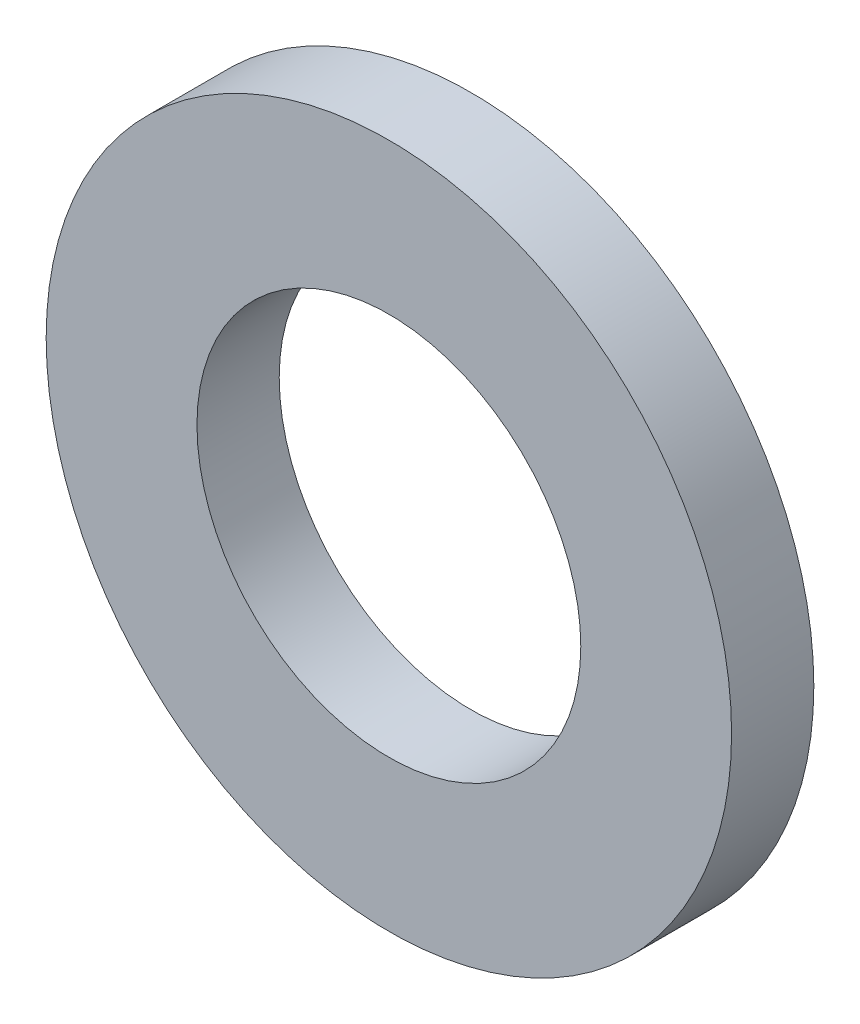
ISO-10303-21;
HEADER;
FILE_DESCRIPTION(('STEP AP214'),'2;1');
FILE_NAME('part.step','',(''),(''),'','','');
FILE_SCHEMA(('AUTOMOTIVE_DESIGN { 1 0 10303 214 1 1 1 1 }'));
ENDSEC;
DATA;
#1=APPLICATION_CONTEXT('core data for automotive mechanical design processes');
#2=APPLICATION_PROTOCOL_DEFINITION('international standard','automotive_design',2000,#1);
#3=PRODUCT_CONTEXT('',#1,'mechanical');
#4=PRODUCT('Part','Part','',(#3));
#5=PRODUCT_RELATED_PRODUCT_CATEGORY('part','',(#4));
#6=PRODUCT_DEFINITION_FORMATION('','',#4);
#7=PRODUCT_DEFINITION_CONTEXT('part definition',#1,'design');
#8=PRODUCT_DEFINITION('design','',#6,#7);
#9=PRODUCT_DEFINITION_SHAPE('','',#8);
#10=(LENGTH_UNIT() NAMED_UNIT(*) SI_UNIT(.MILLI.,.METRE.));
#11=(NAMED_UNIT(*) PLANE_ANGLE_UNIT() SI_UNIT($,.RADIAN.));
#12=(NAMED_UNIT(*) SI_UNIT($,.STERADIAN.) SOLID_ANGLE_UNIT());
#13=UNCERTAINTY_MEASURE_WITH_UNIT(LENGTH_MEASURE(1.E-05),#10,'distance_accuracy_value','');
#14=(GEOMETRIC_REPRESENTATION_CONTEXT(3) GLOBAL_UNCERTAINTY_ASSIGNED_CONTEXT((#13)) GLOBAL_UNIT_ASSIGNED_CONTEXT((#10,
#11,#12)) REPRESENTATION_CONTEXT('',''));
#15=CARTESIAN_POINT('',(0.,0.,0.));
#16=DIRECTION('',(0.,0.,1.));
#17=DIRECTION('',(1.,0.,0.));
#18=AXIS2_PLACEMENT_3D('',#15,#16,#17);
#19=CARTESIAN_POINT('',(0.,0.,1.8));
#20=DIRECTION('',(0.,0.,1.));
#21=DIRECTION('',(1.,0.,0.));
#22=AXIS2_PLACEMENT_3D('',#19,#20,#21);
#23=PLANE('',#22);
#24=CARTESIAN_POINT('',(0.,0.,1.8));
#25=DIRECTION('',(0.,0.,1.));
#26=DIRECTION('',(1.,0.,0.));
#27=AXIS2_PLACEMENT_3D('',#24,#25,#26);
#28=CIRCLE('',#27,7.5);
#29=CARTESIAN_POINT('',(7.5,0.,1.8));
#30=VERTEX_POINT('',#29);
#31=EDGE_CURVE('E10',#30,#30,#28,.T.);
#32=ORIENTED_EDGE('',*,*,#31,.T.);
#33=EDGE_LOOP('',(#32));
#34=FACE_BOUND('',#33,.T.);
#35=CARTESIAN_POINT('',(0.,0.,1.8));
#36=DIRECTION('',(0.,0.,1.));
#37=DIRECTION('',(1.,0.,0.));
#38=AXIS2_PLACEMENT_3D('',#35,#36,#37);
#39=CIRCLE('',#38,4.2);
#40=CARTESIAN_POINT('',(4.2,0.,1.8));
#41=VERTEX_POINT('',#40);
#42=EDGE_CURVE('E43',#41,#41,#39,.T.);
#43=ORIENTED_EDGE('',*,*,#42,.F.);
#44=EDGE_LOOP('',(#43));
#45=FACE_BOUND('',#44,.T.);
#46=ADVANCED_FACE('F32',(#34,#45),#23,.T.);
#47=CARTESIAN_POINT('',(0.,0.,0.));
#48=DIRECTION('',(0.,0.,1.));
#49=DIRECTION('',(1.,0.,0.));
#50=AXIS2_PLACEMENT_3D('',#47,#48,#49);
#51=PLANE('',#50);
#52=CARTESIAN_POINT('',(0.,0.,0.));
#53=DIRECTION('',(0.,0.,1.));
#54=DIRECTION('',(1.,0.,0.));
#55=AXIS2_PLACEMENT_3D('',#52,#53,#54);
#56=CIRCLE('',#55,7.5);
#57=CARTESIAN_POINT('',(7.5,0.,0.));
#58=VERTEX_POINT('',#57);
#59=EDGE_CURVE('E36',#58,#58,#56,.T.);
#60=ORIENTED_EDGE('',*,*,#59,.F.);
#61=EDGE_LOOP('',(#60));
#62=FACE_BOUND('',#61,.T.);
#63=CARTESIAN_POINT('',(0.,0.,0.));
#64=DIRECTION('',(0.,0.,1.));
#65=DIRECTION('',(1.,0.,0.));
#66=AXIS2_PLACEMENT_3D('',#63,#64,#65);
#67=CIRCLE('',#66,4.2);
#68=CARTESIAN_POINT('',(4.2,0.,0.));
#69=VERTEX_POINT('',#68);
#70=EDGE_CURVE('E45',#69,#69,#67,.T.);
#71=ORIENTED_EDGE('',*,*,#70,.T.);
#72=EDGE_LOOP('',(#71));
#73=FACE_BOUND('',#72,.T.);
#74=ADVANCED_FACE('F55',(#62,#73),#51,.F.);
#75=CARTESIAN_POINT('',(0.,0.,1.8));
#76=DIRECTION('',(0.,0.,-1.));
#77=DIRECTION('',(-1.,0.,0.));
#78=AXIS2_PLACEMENT_3D('',#75,#76,#77);
#79=CYLINDRICAL_SURFACE('',#78,7.5);
#80=ORIENTED_EDGE('',*,*,#31,.F.);
#81=EDGE_LOOP('',(#80));
#82=FACE_BOUND('',#81,.T.);
#83=ORIENTED_EDGE('',*,*,#59,.T.);
#84=EDGE_LOOP('',(#83));
#85=FACE_BOUND('',#84,.T.);
#86=ADVANCED_FACE('F34',(#82,#85),#79,.T.);
#87=CARTESIAN_POINT('',(0.,0.,1.8));
#88=DIRECTION('',(0.,0.,-1.));
#89=DIRECTION('',(-1.,0.,0.));
#90=AXIS2_PLACEMENT_3D('',#87,#88,#89);
#91=CYLINDRICAL_SURFACE('',#90,4.2);
#92=ORIENTED_EDGE('',*,*,#42,.T.);
#93=EDGE_LOOP('',(#92));
#94=FACE_BOUND('',#93,.T.);
#95=ORIENTED_EDGE('',*,*,#70,.F.);
#96=EDGE_LOOP('',(#95));
#97=FACE_BOUND('',#96,.T.);
#98=ADVANCED_FACE('F51',(#94,#97),#91,.F.);
#99=CLOSED_SHELL('',(#46,#74,#86,#98));
#100=MANIFOLD_SOLID_BREP('B2',#99);
#101=ADVANCED_BREP_SHAPE_REPRESENTATION('',(#18,#100),#14);
#102=SHAPE_DEFINITION_REPRESENTATION(#9,#101);
ENDSEC;
END-ISO-10303-21;
